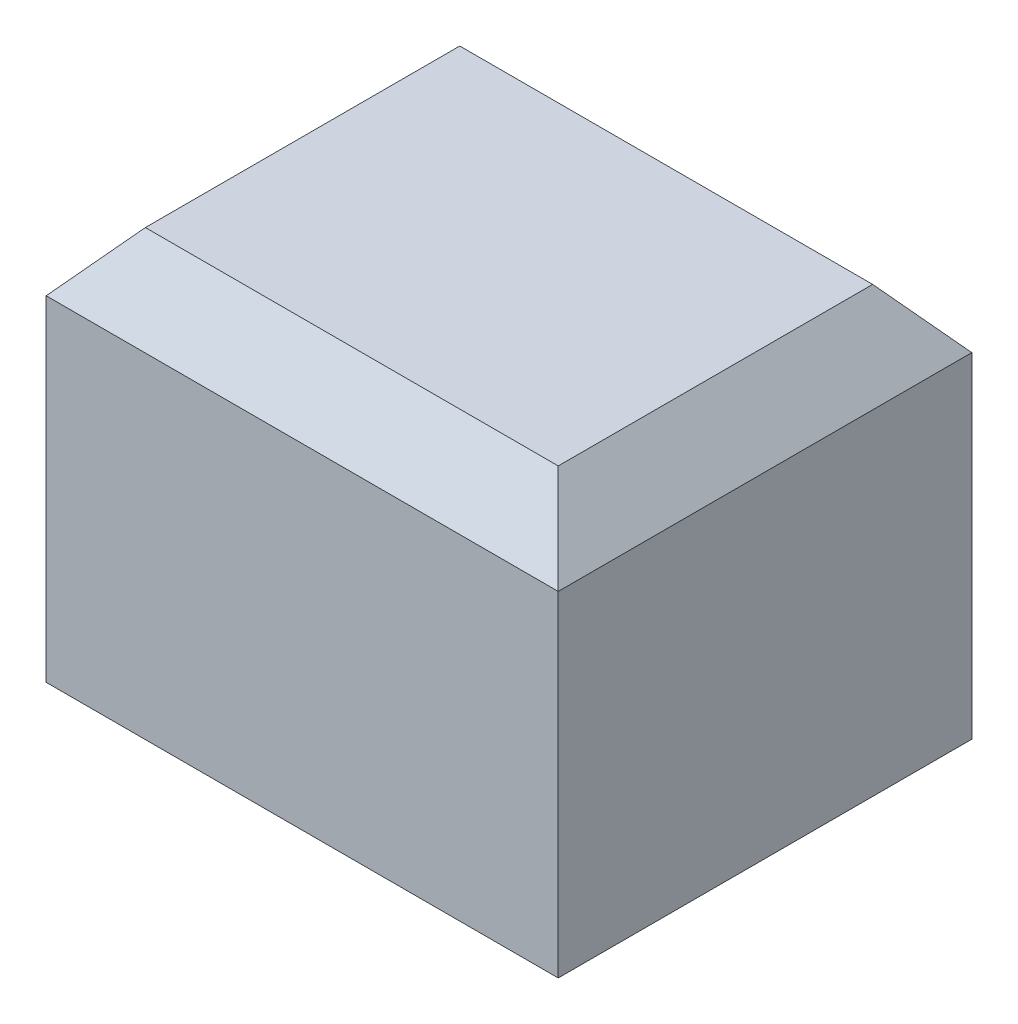
ISO-10303-21;
HEADER;
FILE_DESCRIPTION(('STEP AP214'),'2;1');
FILE_NAME('part.step','',(''),(''),'','','');
FILE_SCHEMA(('AUTOMOTIVE_DESIGN { 1 0 10303 214 1 1 1 1 }'));
ENDSEC;
DATA;
#1=APPLICATION_CONTEXT('core data for automotive mechanical design processes');
#2=APPLICATION_PROTOCOL_DEFINITION('international standard','automotive_design',2000,#1);
#3=PRODUCT_CONTEXT('',#1,'mechanical');
#4=PRODUCT('Part','Part','',(#3));
#5=PRODUCT_RELATED_PRODUCT_CATEGORY('part','',(#4));
#6=PRODUCT_DEFINITION_FORMATION('','',#4);
#7=PRODUCT_DEFINITION_CONTEXT('part definition',#1,'design');
#8=PRODUCT_DEFINITION('design','',#6,#7);
#9=PRODUCT_DEFINITION_SHAPE('','',#8);
#10=(LENGTH_UNIT() NAMED_UNIT(*) SI_UNIT(.MILLI.,.METRE.));
#11=(NAMED_UNIT(*) PLANE_ANGLE_UNIT() SI_UNIT($,.RADIAN.));
#12=(NAMED_UNIT(*) SI_UNIT($,.STERADIAN.) SOLID_ANGLE_UNIT());
#13=UNCERTAINTY_MEASURE_WITH_UNIT(LENGTH_MEASURE(1.E-05),#10,'distance_accuracy_value','');
#14=(GEOMETRIC_REPRESENTATION_CONTEXT(3) GLOBAL_UNCERTAINTY_ASSIGNED_CONTEXT((#13)) GLOBAL_UNIT_ASSIGNED_CONTEXT((#10,
#11,#12)) REPRESENTATION_CONTEXT('',''));
#15=CARTESIAN_POINT('',(0.,0.,0.));
#16=DIRECTION('',(0.,0.,1.));
#17=DIRECTION('',(1.,0.,0.));
#18=AXIS2_PLACEMENT_3D('',#15,#16,#17);
#19=CARTESIAN_POINT('',(0.,0.,0.));
#20=DIRECTION('',(0.,-1.,0.));
#21=DIRECTION('',(0.,0.,-1.));
#22=AXIS2_PLACEMENT_3D('',#19,#20,#21);
#23=PLANE('',#22);
#24=DIRECTION('',(0.,0.,1.));
#25=VECTOR('',#24,1.);
#26=CARTESIAN_POINT('',(-2.6,0.,2.1));
#27=LINE('',#26,#25);
#28=CARTESIAN_POINT('',(-2.6,0.,-2.1));
#29=VERTEX_POINT('',#28);
#30=CARTESIAN_POINT('',(-2.6,0.,2.1));
#31=VERTEX_POINT('',#30);
#32=EDGE_CURVE('E153',#29,#31,#27,.T.);
#33=ORIENTED_EDGE('',*,*,#32,.F.);
#34=DIRECTION('',(-1.,0.,0.));
#35=VECTOR('',#34,1.);
#36=CARTESIAN_POINT('',(-2.6,0.,-2.1));
#37=LINE('',#36,#35);
#38=CARTESIAN_POINT('',(2.6,0.,-2.1));
#39=VERTEX_POINT('',#38);
#40=EDGE_CURVE('E172',#39,#29,#37,.T.);
#41=ORIENTED_EDGE('',*,*,#40,.F.);
#42=DIRECTION('',(0.,0.,-1.));
#43=VECTOR('',#42,1.);
#44=CARTESIAN_POINT('',(2.6,0.,2.1));
#45=LINE('',#44,#43);
#46=CARTESIAN_POINT('',(2.6,0.,2.1));
#47=VERTEX_POINT('',#46);
#48=EDGE_CURVE('E168',#47,#39,#45,.T.);
#49=ORIENTED_EDGE('',*,*,#48,.F.);
#50=DIRECTION('',(1.,0.,0.));
#51=VECTOR('',#50,1.);
#52=CARTESIAN_POINT('',(-2.6,0.,2.1));
#53=LINE('',#52,#51);
#54=EDGE_CURVE('E159',#31,#47,#53,.T.);
#55=ORIENTED_EDGE('',*,*,#54,.F.);
#56=EDGE_LOOP('',(#33,#41,#49,#55));
#57=FACE_BOUND('',#56,.T.);
#58=DIRECTION('',(1.,0.,0.));
#59=VECTOR('',#58,1.);
#60=CARTESIAN_POINT('',(-1.5,0.,1.));
#61=LINE('',#60,#59);
#62=CARTESIAN_POINT('',(-1.5,0.,1.));
#63=VERTEX_POINT('',#62);
#64=CARTESIAN_POINT('',(1.5,0.,1.));
#65=VERTEX_POINT('',#64);
#66=EDGE_CURVE('E147',#63,#65,#61,.T.);
#67=ORIENTED_EDGE('',*,*,#66,.T.);
#68=DIRECTION('',(0.,0.,-1.));
#69=VECTOR('',#68,1.);
#70=CARTESIAN_POINT('',(1.5,0.,1.));
#71=LINE('',#70,#69);
#72=CARTESIAN_POINT('',(1.5,0.,-1.));
#73=VERTEX_POINT('',#72);
#74=EDGE_CURVE('E223',#65,#73,#71,.T.);
#75=ORIENTED_EDGE('',*,*,#74,.T.);
#76=DIRECTION('',(-1.,0.,0.));
#77=VECTOR('',#76,1.);
#78=CARTESIAN_POINT('',(-1.5,0.,-1.));
#79=LINE('',#78,#77);
#80=CARTESIAN_POINT('',(-1.5,0.,-1.));
#81=VERTEX_POINT('',#80);
#82=EDGE_CURVE('E151',#73,#81,#79,.T.);
#83=ORIENTED_EDGE('',*,*,#82,.T.);
#84=DIRECTION('',(0.,0.,1.));
#85=VECTOR('',#84,1.);
#86=CARTESIAN_POINT('',(-1.5,0.,1.));
#87=LINE('',#86,#85);
#88=EDGE_CURVE('E232',#81,#63,#87,.T.);
#89=ORIENTED_EDGE('',*,*,#88,.T.);
#90=EDGE_LOOP('',(#67,#75,#83,#89));
#91=FACE_BOUND('',#90,.T.);
#92=ADVANCED_FACE('F47',(#57,#91),#23,.T.);
#93=CARTESIAN_POINT('',(-2.6,2.8,2.1));
#94=DIRECTION('',(1.,0.,0.));
#95=DIRECTION('',(0.,0.,-1.));
#96=AXIS2_PLACEMENT_3D('',#93,#94,#95);
#97=PLANE('',#96);
#98=DIRECTION('',(0.,-1.,0.));
#99=VECTOR('',#98,1.);
#100=CARTESIAN_POINT('',(-2.6,2.8,2.1));
#101=LINE('',#100,#99);
#102=CARTESIAN_POINT('',(-2.6,3.4,2.1));
#103=VERTEX_POINT('',#102);
#104=EDGE_CURVE('E185',#103,#31,#101,.T.);
#105=ORIENTED_EDGE('',*,*,#104,.F.);
#106=DIRECTION('',(0.,0.,-1.));
#107=VECTOR('',#106,1.);
#108=CARTESIAN_POINT('',(-2.6,3.4,2.1));
#109=LINE('',#108,#107);
#110=CARTESIAN_POINT('',(-2.6,3.4,-2.1));
#111=VERTEX_POINT('',#110);
#112=EDGE_CURVE('E11',#103,#111,#109,.T.);
#113=ORIENTED_EDGE('',*,*,#112,.T.);
#114=DIRECTION('',(0.,-1.,0.));
#115=VECTOR('',#114,1.);
#116=CARTESIAN_POINT('',(-2.6,2.8,-2.1));
#117=LINE('',#116,#115);
#118=EDGE_CURVE('E176',#111,#29,#117,.T.);
#119=ORIENTED_EDGE('',*,*,#118,.T.);
#120=ORIENTED_EDGE('',*,*,#32,.T.);
#121=EDGE_LOOP('',(#105,#113,#119,#120));
#122=FACE_BOUND('',#121,.T.);
#123=ADVANCED_FACE('F253',(#122),#97,.F.);
#124=CARTESIAN_POINT('',(-2.6,2.8,2.1));
#125=DIRECTION('',(0.,0.,-1.));
#126=DIRECTION('',(-1.,0.,0.));
#127=AXIS2_PLACEMENT_3D('',#124,#125,#126);
#128=PLANE('',#127);
#129=DIRECTION('',(0.,-1.,0.));
#130=VECTOR('',#129,1.);
#131=CARTESIAN_POINT('',(2.6,2.8,2.1));
#132=LINE('',#131,#130);
#133=CARTESIAN_POINT('',(2.6,3.4,2.1));
#134=VERTEX_POINT('',#133);
#135=EDGE_CURVE('E182',#134,#47,#132,.T.);
#136=ORIENTED_EDGE('',*,*,#135,.F.);
#137=DIRECTION('',(-1.,0.,0.));
#138=VECTOR('',#137,1.);
#139=CARTESIAN_POINT('',(-2.6,3.4,2.1));
#140=LINE('',#139,#138);
#141=EDGE_CURVE('E58',#134,#103,#140,.T.);
#142=ORIENTED_EDGE('',*,*,#141,.T.);
#143=ORIENTED_EDGE('',*,*,#104,.T.);
#144=ORIENTED_EDGE('',*,*,#54,.T.);
#145=EDGE_LOOP('',(#136,#142,#143,#144));
#146=FACE_BOUND('',#145,.T.);
#147=ADVANCED_FACE('F260',(#146),#128,.F.);
#148=CARTESIAN_POINT('',(2.6,2.8,2.1));
#149=DIRECTION('',(-1.,0.,0.));
#150=DIRECTION('',(0.,0.,1.));
#151=AXIS2_PLACEMENT_3D('',#148,#149,#150);
#152=PLANE('',#151);
#153=DIRECTION('',(0.,-1.,0.));
#154=VECTOR('',#153,1.);
#155=CARTESIAN_POINT('',(2.6,2.8,-2.1));
#156=LINE('',#155,#154);
#157=CARTESIAN_POINT('',(2.6,3.4,-2.1));
#158=VERTEX_POINT('',#157);
#159=EDGE_CURVE('E179',#158,#39,#156,.T.);
#160=ORIENTED_EDGE('',*,*,#159,.F.);
#161=DIRECTION('',(0.,0.,1.));
#162=VECTOR('',#161,1.);
#163=CARTESIAN_POINT('',(2.6,3.4,2.1));
#164=LINE('',#163,#162);
#165=EDGE_CURVE('E73',#158,#134,#164,.T.);
#166=ORIENTED_EDGE('',*,*,#165,.T.);
#167=ORIENTED_EDGE('',*,*,#135,.T.);
#168=ORIENTED_EDGE('',*,*,#48,.T.);
#169=EDGE_LOOP('',(#160,#166,#167,#168));
#170=FACE_BOUND('',#169,.T.);
#171=ADVANCED_FACE('F270',(#170),#152,.F.);
#172=CARTESIAN_POINT('',(-2.6,2.8,-2.1));
#173=DIRECTION('',(0.,0.,1.));
#174=DIRECTION('',(1.,0.,0.));
#175=AXIS2_PLACEMENT_3D('',#172,#173,#174);
#176=PLANE('',#175);
#177=ORIENTED_EDGE('',*,*,#118,.F.);
#178=DIRECTION('',(1.,0.,0.));
#179=VECTOR('',#178,1.);
#180=CARTESIAN_POINT('',(-2.6,3.4,-2.1));
#181=LINE('',#180,#179);
#182=EDGE_CURVE('E201',#111,#158,#181,.T.);
#183=ORIENTED_EDGE('',*,*,#182,.T.);
#184=ORIENTED_EDGE('',*,*,#159,.T.);
#185=ORIENTED_EDGE('',*,*,#40,.T.);
#186=EDGE_LOOP('',(#177,#183,#184,#185));
#187=FACE_BOUND('',#186,.T.);
#188=ADVANCED_FACE('F267',(#187),#176,.F.);
#189=CARTESIAN_POINT('',(1.5,2.8,1.));
#190=DIRECTION('',(-1.,0.,0.));
#191=DIRECTION('',(0.,0.,1.));
#192=AXIS2_PLACEMENT_3D('',#189,#190,#191);
#193=PLANE('',#192);
#194=ORIENTED_EDGE('',*,*,#74,.F.);
#195=DIRECTION('',(0.,-1.,0.));
#196=VECTOR('',#195,1.);
#197=CARTESIAN_POINT('',(1.5,2.8,1.));
#198=LINE('',#197,#196);
#199=CARTESIAN_POINT('',(1.5,2.8,1.));
#200=VERTEX_POINT('',#199);
#201=EDGE_CURVE('E145',#200,#65,#198,.T.);
#202=ORIENTED_EDGE('',*,*,#201,.F.);
#203=DIRECTION('',(0.,0.,-1.));
#204=VECTOR('',#203,1.);
#205=CARTESIAN_POINT('',(1.5,2.8,1.));
#206=LINE('',#205,#204);
#207=CARTESIAN_POINT('',(1.5,2.8,-1.));
#208=VERTEX_POINT('',#207);
#209=EDGE_CURVE('E129',#200,#208,#206,.T.);
#210=ORIENTED_EDGE('',*,*,#209,.T.);
#211=DIRECTION('',(0.,-1.,0.));
#212=VECTOR('',#211,1.);
#213=CARTESIAN_POINT('',(1.5,2.8,-1.));
#214=LINE('',#213,#212);
#215=EDGE_CURVE('E142',#208,#73,#214,.T.);
#216=ORIENTED_EDGE('',*,*,#215,.T.);
#217=EDGE_LOOP('',(#194,#202,#210,#216));
#218=FACE_BOUND('',#217,.T.);
#219=ADVANCED_FACE('F141',(#218),#193,.T.);
#220=CARTESIAN_POINT('',(-1.5,2.8,-1.));
#221=DIRECTION('',(0.,0.,1.));
#222=DIRECTION('',(1.,0.,0.));
#223=AXIS2_PLACEMENT_3D('',#220,#221,#222);
#224=PLANE('',#223);
#225=ORIENTED_EDGE('',*,*,#82,.F.);
#226=ORIENTED_EDGE('',*,*,#215,.F.);
#227=DIRECTION('',(-1.,0.,0.));
#228=VECTOR('',#227,1.);
#229=CARTESIAN_POINT('',(-1.5,2.8,-1.));
#230=LINE('',#229,#228);
#231=CARTESIAN_POINT('',(-1.5,2.8,-1.));
#232=VERTEX_POINT('',#231);
#233=EDGE_CURVE('E126',#208,#232,#230,.T.);
#234=ORIENTED_EDGE('',*,*,#233,.T.);
#235=DIRECTION('',(0.,-1.,0.));
#236=VECTOR('',#235,1.);
#237=CARTESIAN_POINT('',(-1.5,2.8,-1.));
#238=LINE('',#237,#236);
#239=EDGE_CURVE('E154',#232,#81,#238,.T.);
#240=ORIENTED_EDGE('',*,*,#239,.T.);
#241=EDGE_LOOP('',(#225,#226,#234,#240));
#242=FACE_BOUND('',#241,.T.);
#243=ADVANCED_FACE('F149',(#242),#224,.T.);
#244=CARTESIAN_POINT('',(-1.5,2.8,1.));
#245=DIRECTION('',(1.,0.,0.));
#246=DIRECTION('',(0.,0.,-1.));
#247=AXIS2_PLACEMENT_3D('',#244,#245,#246);
#248=PLANE('',#247);
#249=ORIENTED_EDGE('',*,*,#88,.F.);
#250=ORIENTED_EDGE('',*,*,#239,.F.);
#251=DIRECTION('',(0.,0.,1.));
#252=VECTOR('',#251,1.);
#253=CARTESIAN_POINT('',(-1.5,2.8,1.));
#254=LINE('',#253,#252);
#255=CARTESIAN_POINT('',(-1.5,2.8,1.));
#256=VERTEX_POINT('',#255);
#257=EDGE_CURVE('E132',#232,#256,#254,.T.);
#258=ORIENTED_EDGE('',*,*,#257,.T.);
#259=DIRECTION('',(0.,-1.,0.));
#260=VECTOR('',#259,1.);
#261=CARTESIAN_POINT('',(-1.5,2.8,1.));
#262=LINE('',#261,#260);
#263=EDGE_CURVE('E161',#256,#63,#262,.T.);
#264=ORIENTED_EDGE('',*,*,#263,.T.);
#265=EDGE_LOOP('',(#249,#250,#258,#264));
#266=FACE_BOUND('',#265,.T.);
#267=ADVANCED_FACE('F249',(#266),#248,.T.);
#268=CARTESIAN_POINT('',(-1.5,2.8,1.));
#269=DIRECTION('',(0.,0.,-1.));
#270=DIRECTION('',(-1.,0.,0.));
#271=AXIS2_PLACEMENT_3D('',#268,#269,#270);
#272=PLANE('',#271);
#273=ORIENTED_EDGE('',*,*,#66,.F.);
#274=ORIENTED_EDGE('',*,*,#263,.F.);
#275=DIRECTION('',(1.,0.,0.));
#276=VECTOR('',#275,1.);
#277=CARTESIAN_POINT('',(-1.5,2.8,1.));
#278=LINE('',#277,#276);
#279=EDGE_CURVE('E235',#256,#200,#278,.T.);
#280=ORIENTED_EDGE('',*,*,#279,.T.);
#281=ORIENTED_EDGE('',*,*,#201,.T.);
#282=EDGE_LOOP('',(#273,#274,#280,#281));
#283=FACE_BOUND('',#282,.T.);
#284=ADVANCED_FACE('F251',(#283),#272,.T.);
#285=CARTESIAN_POINT('',(0.,2.8,0.));
#286=DIRECTION('',(0.,-1.,0.));
#287=DIRECTION('',(0.,0.,-1.));
#288=AXIS2_PLACEMENT_3D('',#285,#286,#287);
#289=PLANE('',#288);
#290=ORIENTED_EDGE('',*,*,#209,.F.);
#291=ORIENTED_EDGE('',*,*,#279,.F.);
#292=ORIENTED_EDGE('',*,*,#257,.F.);
#293=ORIENTED_EDGE('',*,*,#233,.F.);
#294=EDGE_LOOP('',(#290,#291,#292,#293));
#295=FACE_BOUND('',#294,.T.);
#296=ADVANCED_FACE('F128',(#295),#289,.T.);
#297=CARTESIAN_POINT('',(0.,4.,0.));
#298=DIRECTION('',(0.,-1.,0.));
#299=DIRECTION('',(0.,0.,-1.));
#300=AXIS2_PLACEMENT_3D('',#297,#298,#299);
#301=PLANE('',#300);
#302=DIRECTION('',(0.,0.,-1.));
#303=VECTOR('',#302,1.);
#304=CARTESIAN_POINT('',(2.09654022129363,4.,0.));
#305=LINE('',#304,#303);
#306=CARTESIAN_POINT('',(2.09654022129363,4.,1.59654022129363));
#307=VERTEX_POINT('',#306);
#308=CARTESIAN_POINT('',(2.09654022129363,4.,-1.59654022129363));
#309=VERTEX_POINT('',#308);
#310=EDGE_CURVE('E194',#307,#309,#305,.T.);
#311=ORIENTED_EDGE('',*,*,#310,.T.);
#312=DIRECTION('',(-1.,0.,0.));
#313=VECTOR('',#312,1.);
#314=CARTESIAN_POINT('',(0.,4.,-1.59654022129363));
#315=LINE('',#314,#313);
#316=CARTESIAN_POINT('',(-2.09654022129363,4.,-1.59654022129363));
#317=VERTEX_POINT('',#316);
#318=EDGE_CURVE('E197',#309,#317,#315,.T.);
#319=ORIENTED_EDGE('',*,*,#318,.T.);
#320=DIRECTION('',(0.,0.,1.));
#321=VECTOR('',#320,1.);
#322=CARTESIAN_POINT('',(-2.09654022129363,4.,0.));
#323=LINE('',#322,#321);
#324=CARTESIAN_POINT('',(-2.09654022129363,4.,1.59654022129363));
#325=VERTEX_POINT('',#324);
#326=EDGE_CURVE('E188',#317,#325,#323,.T.);
#327=ORIENTED_EDGE('',*,*,#326,.T.);
#328=DIRECTION('',(1.,0.,0.));
#329=VECTOR('',#328,1.);
#330=CARTESIAN_POINT('',(0.,4.,1.59654022129363));
#331=LINE('',#330,#329);
#332=EDGE_CURVE('E191',#325,#307,#331,.T.);
#333=ORIENTED_EDGE('',*,*,#332,.T.);
#334=EDGE_LOOP('',(#311,#319,#327,#333));
#335=FACE_BOUND('',#334,.T.);
#336=ADVANCED_FACE('F296',(#335),#301,.F.);
#337=CARTESIAN_POINT('',(0.,4.,1.59654022129363));
#338=DIRECTION('',(0.,-0.642787609686538,-0.766044443118979));
#339=DIRECTION('',(1.,0.,0.));
#340=AXIS2_PLACEMENT_3D('',#337,#338,#339);
#341=PLANE('',#340);
#342=DIRECTION('',(0.540716203060936,0.644400477571773,-0.540716203060936));
#343=VECTOR('',#342,1.);
#344=CARTESIAN_POINT('',(-1.6297533510713,4.55629492956327,1.1297533510713));
#345=LINE('',#344,#343);
#346=EDGE_CURVE('E214',#103,#325,#345,.T.);
#347=ORIENTED_EDGE('',*,*,#346,.F.);
#348=ORIENTED_EDGE('',*,*,#141,.F.);
#349=DIRECTION('',(-0.540716203060936,0.644400477571773,-0.540716203060936));
#350=VECTOR('',#349,1.);
#351=CARTESIAN_POINT('',(1.48356634494498,4.7305138193049,0.983566344944984));
#352=LINE('',#351,#350);
#353=EDGE_CURVE('E52',#307,#134,#352,.F.);
#354=ORIENTED_EDGE('',*,*,#353,.F.);
#355=ORIENTED_EDGE('',*,*,#332,.F.);
#356=EDGE_LOOP('',(#347,#348,#354,#355));
#357=FACE_BOUND('',#356,.T.);
#358=ADVANCED_FACE('F50',(#357),#341,.F.);
#359=CARTESIAN_POINT('',(2.09654022129363,4.,0.));
#360=DIRECTION('',(-0.766044443118979,-0.642787609686538,0.));
#361=DIRECTION('',(0.,0.,-1.));
#362=AXIS2_PLACEMENT_3D('',#359,#360,#361);
#363=PLANE('',#362);
#364=ORIENTED_EDGE('',*,*,#353,.T.);
#365=ORIENTED_EDGE('',*,*,#165,.F.);
#366=DIRECTION('',(-0.540716203060936,0.644400477571773,0.540716203060936));
#367=VECTOR('',#366,1.);
#368=CARTESIAN_POINT('',(1.6297533510713,4.55629492956327,-1.1297533510713));
#369=LINE('',#368,#367);
#370=EDGE_CURVE('E212',#309,#158,#369,.F.);
#371=ORIENTED_EDGE('',*,*,#370,.F.);
#372=ORIENTED_EDGE('',*,*,#310,.F.);
#373=EDGE_LOOP('',(#364,#365,#371,#372));
#374=FACE_BOUND('',#373,.T.);
#375=ADVANCED_FACE('F289',(#374),#363,.F.);
#376=CARTESIAN_POINT('',(-2.09654022129363,4.,0.));
#377=DIRECTION('',(0.766044443118979,-0.642787609686538,0.));
#378=DIRECTION('',(0.,0.,1.));
#379=AXIS2_PLACEMENT_3D('',#376,#377,#378);
#380=PLANE('',#379);
#381=ORIENTED_EDGE('',*,*,#346,.T.);
#382=ORIENTED_EDGE('',*,*,#326,.F.);
#383=DIRECTION('',(-0.540716203060936,-0.644400477571773,-0.540716203060936));
#384=VECTOR('',#383,1.);
#385=CARTESIAN_POINT('',(-1.6297533510713,4.55629492956327,-1.1297533510713));
#386=LINE('',#385,#384);
#387=EDGE_CURVE('E209',#111,#317,#386,.F.);
#388=ORIENTED_EDGE('',*,*,#387,.F.);
#389=ORIENTED_EDGE('',*,*,#112,.F.);
#390=EDGE_LOOP('',(#381,#382,#388,#389));
#391=FACE_BOUND('',#390,.T.);
#392=ADVANCED_FACE('F283',(#391),#380,.F.);
#393=CARTESIAN_POINT('',(0.,4.,-1.59654022129363));
#394=DIRECTION('',(0.,-0.642787609686538,0.766044443118979));
#395=DIRECTION('',(-1.,0.,0.));
#396=AXIS2_PLACEMENT_3D('',#393,#394,#395);
#397=PLANE('',#396);
#398=ORIENTED_EDGE('',*,*,#370,.T.);
#399=ORIENTED_EDGE('',*,*,#182,.F.);
#400=ORIENTED_EDGE('',*,*,#387,.T.);
#401=ORIENTED_EDGE('',*,*,#318,.F.);
#402=EDGE_LOOP('',(#398,#399,#400,#401));
#403=FACE_BOUND('',#402,.T.);
#404=ADVANCED_FACE('F277',(#403),#397,.F.);
#405=CLOSED_SHELL('',(#92,#123,#147,#171,#188,#219,#243,#267,#284,#296,#336,#358,#375,#392,#404));
#406=MANIFOLD_SOLID_BREP('B2',#405);
#407=ADVANCED_BREP_SHAPE_REPRESENTATION('',(#18,#406),#14);
#408=SHAPE_DEFINITION_REPRESENTATION(#9,#407);
ENDSEC;
END-ISO-10303-21;
